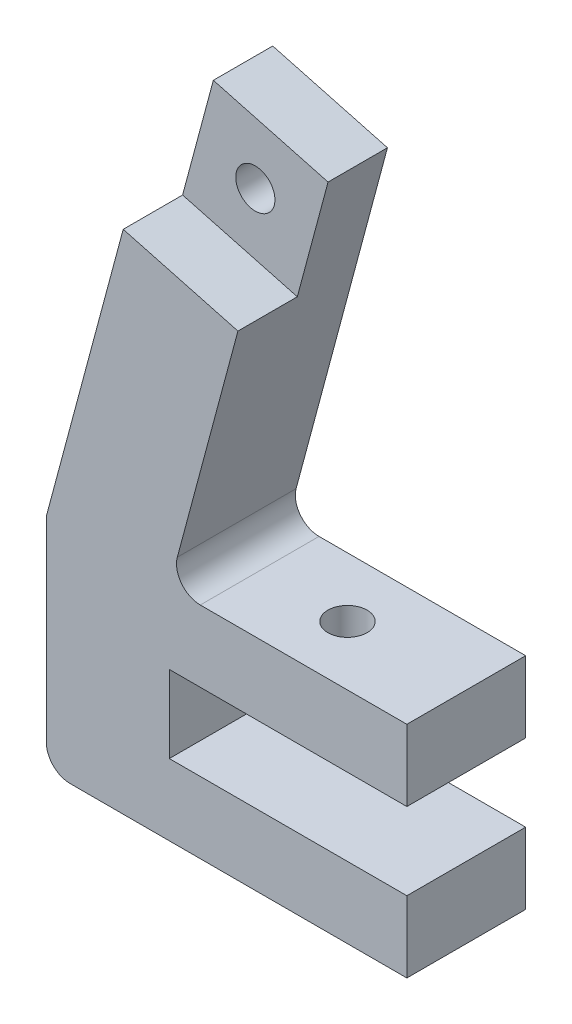
ISO-10303-21;
HEADER;
FILE_DESCRIPTION(('STEP AP214'),'2;1');
FILE_NAME('part.step','',(''),(''),'','','');
FILE_SCHEMA(('AUTOMOTIVE_DESIGN { 1 0 10303 214 1 1 1 1 }'));
ENDSEC;
DATA;
#1=APPLICATION_CONTEXT('core data for automotive mechanical design processes');
#2=APPLICATION_PROTOCOL_DEFINITION('international standard','automotive_design',2000,#1);
#3=PRODUCT_CONTEXT('',#1,'mechanical');
#4=PRODUCT('Part','Part','',(#3));
#5=PRODUCT_RELATED_PRODUCT_CATEGORY('part','',(#4));
#6=PRODUCT_DEFINITION_FORMATION('','',#4);
#7=PRODUCT_DEFINITION_CONTEXT('part definition',#1,'design');
#8=PRODUCT_DEFINITION('design','',#6,#7);
#9=PRODUCT_DEFINITION_SHAPE('','',#8);
#10=(LENGTH_UNIT() NAMED_UNIT(*) SI_UNIT(.MILLI.,.METRE.));
#11=(NAMED_UNIT(*) PLANE_ANGLE_UNIT() SI_UNIT($,.RADIAN.));
#12=(NAMED_UNIT(*) SI_UNIT($,.STERADIAN.) SOLID_ANGLE_UNIT());
#13=UNCERTAINTY_MEASURE_WITH_UNIT(LENGTH_MEASURE(1.E-05),#10,'distance_accuracy_value','');
#14=(GEOMETRIC_REPRESENTATION_CONTEXT(3) GLOBAL_UNCERTAINTY_ASSIGNED_CONTEXT((#13)) GLOBAL_UNIT_ASSIGNED_CONTEXT((#10,
#11,#12)) REPRESENTATION_CONTEXT('',''));
#15=CARTESIAN_POINT('',(0.,0.,0.));
#16=DIRECTION('',(0.,0.,1.));
#17=DIRECTION('',(1.,0.,0.));
#18=AXIS2_PLACEMENT_3D('',#15,#16,#17);
#19=CARTESIAN_POINT('',(-17.7585613195798,46.1836795631594,5.));
#20=DIRECTION('',(0.,0.,1.));
#21=DIRECTION('',(1.,0.,0.));
#22=AXIS2_PLACEMENT_3D('',#19,#20,#21);
#23=CYLINDRICAL_SURFACE('',#22,1.65);
#24=CARTESIAN_POINT('',(-17.7585613195798,46.1836795631594,5.));
#25=DIRECTION('',(0.,0.,1.));
#26=DIRECTION('',(1.,0.,0.));
#27=AXIS2_PLACEMENT_3D('',#24,#25,#26);
#28=CIRCLE('',#27,1.65);
#29=CARTESIAN_POINT('',(-16.1085613195798,46.1836795631594,5.));
#30=VERTEX_POINT('',#29);
#31=EDGE_CURVE('E412',#30,#30,#28,.T.);
#32=ORIENTED_EDGE('',*,*,#31,.T.);
#33=EDGE_LOOP('',(#32));
#34=FACE_BOUND('',#33,.T.);
#35=CARTESIAN_POINT('',(-17.7585613195798,46.1836795631594,1.));
#36=DIRECTION('',(0.,0.,-1.));
#37=DIRECTION('',(-1.,0.,0.));
#38=AXIS2_PLACEMENT_3D('',#35,#36,#37);
#39=CIRCLE('',#38,1.65);
#40=CARTESIAN_POINT('',(-19.4085613195798,46.1836795631594,1.));
#41=VERTEX_POINT('',#40);
#42=EDGE_CURVE('E43',#41,#41,#39,.F.);
#43=ORIENTED_EDGE('',*,*,#42,.F.);
#44=EDGE_LOOP('',(#43));
#45=FACE_BOUND('',#44,.T.);
#46=ADVANCED_FACE('F39',(#34,#45),#23,.F.);
#47=CARTESIAN_POINT('',(0.,18.5,10.));
#48=DIRECTION('',(0.,-1.,0.));
#49=DIRECTION('',(1.,0.,0.));
#50=AXIS2_PLACEMENT_3D('',#47,#48,#49);
#51=PLANE('',#50);
#52=DIRECTION('',(-1.,0.,0.));
#53=VECTOR('',#52,1.);
#54=CARTESIAN_POINT('',(0.,18.5,0.));
#55=LINE('',#54,#53);
#56=CARTESIAN_POINT('',(0.,18.5,0.));
#57=VERTEX_POINT('',#56);
#58=CARTESIAN_POINT('',(-17.3935492543176,18.5,0.));
#59=VERTEX_POINT('',#58);
#60=EDGE_CURVE('E233',#57,#59,#55,.T.);
#61=ORIENTED_EDGE('',*,*,#60,.T.);
#62=DIRECTION('',(0.,0.,-1.));
#63=VECTOR('',#62,1.);
#64=CARTESIAN_POINT('',(-17.3935492543176,18.5,10.));
#65=LINE('',#64,#63);
#66=CARTESIAN_POINT('',(-17.3935492543176,18.5,10.));
#67=VERTEX_POINT('',#66);
#68=EDGE_CURVE('E287',#59,#67,#65,.F.);
#69=ORIENTED_EDGE('',*,*,#68,.T.);
#70=DIRECTION('',(-1.,0.,0.));
#71=VECTOR('',#70,1.);
#72=CARTESIAN_POINT('',(0.,18.5,10.));
#73=LINE('',#72,#71);
#74=CARTESIAN_POINT('',(0.,18.5,10.));
#75=VERTEX_POINT('',#74);
#76=EDGE_CURVE('E203',#75,#67,#73,.T.);
#77=ORIENTED_EDGE('',*,*,#76,.F.);
#78=DIRECTION('',(0.,0.,-1.));
#79=VECTOR('',#78,1.);
#80=CARTESIAN_POINT('',(0.,18.5,10.));
#81=LINE('',#80,#79);
#82=EDGE_CURVE('E259',#75,#57,#81,.T.);
#83=ORIENTED_EDGE('',*,*,#82,.T.);
#84=EDGE_LOOP('',(#61,#69,#77,#83));
#85=FACE_BOUND('',#84,.T.);
#86=CARTESIAN_POINT('',(-10.,18.5,5.));
#87=DIRECTION('',(0.,1.,0.));
#88=DIRECTION('',(0.,0.,1.));
#89=AXIS2_PLACEMENT_3D('',#86,#87,#88);
#90=CIRCLE('',#89,1.65);
#91=CARTESIAN_POINT('',(-10.,18.5,6.65));
#92=VERTEX_POINT('',#91);
#93=EDGE_CURVE('E407',#92,#92,#90,.T.);
#94=ORIENTED_EDGE('',*,*,#93,.F.);
#95=EDGE_LOOP('',(#94));
#96=FACE_BOUND('',#95,.T.);
#97=ADVANCED_FACE('F336',(#85,#96),#51,.F.);
#98=CARTESIAN_POINT('',(-30.3527618041008,0.,10.));
#99=DIRECTION('',(0.,1.,0.));
#100=DIRECTION('',(0.,0.,1.));
#101=AXIS2_PLACEMENT_3D('',#98,#99,#100);
#102=PLANE('',#101);
#103=DIRECTION('',(1.,0.,0.));
#104=VECTOR('',#103,1.);
#105=CARTESIAN_POINT('',(-30.3527618041008,0.,10.));
#106=LINE('',#105,#104);
#107=CARTESIAN_POINT('',(-28.3527618041008,0.,10.));
#108=VERTEX_POINT('',#107);
#109=CARTESIAN_POINT('',(0.,0.,10.));
#110=VERTEX_POINT('',#109);
#111=EDGE_CURVE('E184',#108,#110,#106,.T.);
#112=ORIENTED_EDGE('',*,*,#111,.F.);
#113=DIRECTION('',(0.,0.,-1.));
#114=VECTOR('',#113,1.);
#115=CARTESIAN_POINT('',(-28.3527618041008,0.,10.));
#116=LINE('',#115,#114);
#117=CARTESIAN_POINT('',(-28.3527618041008,0.,0.));
#118=VERTEX_POINT('',#117);
#119=EDGE_CURVE('E296',#108,#118,#116,.T.);
#120=ORIENTED_EDGE('',*,*,#119,.T.);
#121=DIRECTION('',(1.,0.,0.));
#122=VECTOR('',#121,1.);
#123=CARTESIAN_POINT('',(-30.3527618041008,0.,0.));
#124=LINE('',#123,#122);
#125=CARTESIAN_POINT('',(0.,0.,0.));
#126=VERTEX_POINT('',#125);
#127=EDGE_CURVE('E179',#118,#126,#124,.T.);
#128=ORIENTED_EDGE('',*,*,#127,.T.);
#129=DIRECTION('',(0.,0.,-1.));
#130=VECTOR('',#129,1.);
#131=CARTESIAN_POINT('',(0.,0.,10.));
#132=LINE('',#131,#130);
#133=EDGE_CURVE('E279',#110,#126,#132,.T.);
#134=ORIENTED_EDGE('',*,*,#133,.F.);
#135=EDGE_LOOP('',(#112,#120,#128,#134));
#136=FACE_BOUND('',#135,.T.);
#137=ADVANCED_FACE('F306',(#136),#102,.F.);
#138=CARTESIAN_POINT('',(0.,0.,10.));
#139=DIRECTION('',(-1.,0.,0.));
#140=DIRECTION('',(0.,0.,1.));
#141=AXIS2_PLACEMENT_3D('',#138,#139,#140);
#142=PLANE('',#141);
#143=DIRECTION('',(0.,1.,0.));
#144=VECTOR('',#143,1.);
#145=CARTESIAN_POINT('',(0.,0.,0.));
#146=LINE('',#145,#144);
#147=CARTESIAN_POINT('',(0.,6.,0.));
#148=VERTEX_POINT('',#147);
#149=EDGE_CURVE('E218',#126,#148,#146,.T.);
#150=ORIENTED_EDGE('',*,*,#149,.T.);
#151=DIRECTION('',(0.,0.,-1.));
#152=VECTOR('',#151,1.);
#153=CARTESIAN_POINT('',(0.,6.,10.));
#154=LINE('',#153,#152);
#155=CARTESIAN_POINT('',(0.,6.,10.));
#156=VERTEX_POINT('',#155);
#157=EDGE_CURVE('E275',#156,#148,#154,.T.);
#158=ORIENTED_EDGE('',*,*,#157,.F.);
#159=DIRECTION('',(0.,1.,0.));
#160=VECTOR('',#159,1.);
#161=CARTESIAN_POINT('',(0.,0.,10.));
#162=LINE('',#161,#160);
#163=EDGE_CURVE('E187',#110,#156,#162,.T.);
#164=ORIENTED_EDGE('',*,*,#163,.F.);
#165=ORIENTED_EDGE('',*,*,#133,.T.);
#166=EDGE_LOOP('',(#150,#158,#164,#165));
#167=FACE_BOUND('',#166,.T.);
#168=ADVANCED_FACE('F317',(#167),#142,.F.);
#169=CARTESIAN_POINT('',(0.,6.,10.));
#170=DIRECTION('',(0.,-1.,0.));
#171=DIRECTION('',(1.,0.,0.));
#172=AXIS2_PLACEMENT_3D('',#169,#170,#171);
#173=PLANE('',#172);
#174=DIRECTION('',(-1.,0.,0.));
#175=VECTOR('',#174,1.);
#176=CARTESIAN_POINT('',(0.,6.,0.));
#177=LINE('',#176,#175);
#178=CARTESIAN_POINT('',(-20.,6.,0.));
#179=VERTEX_POINT('',#178);
#180=EDGE_CURVE('E221',#148,#179,#177,.T.);
#181=ORIENTED_EDGE('',*,*,#180,.T.);
#182=DIRECTION('',(0.,0.,-1.));
#183=VECTOR('',#182,1.);
#184=CARTESIAN_POINT('',(-20.,6.,10.));
#185=LINE('',#184,#183);
#186=CARTESIAN_POINT('',(-20.,6.,10.));
#187=VERTEX_POINT('',#186);
#188=EDGE_CURVE('E271',#187,#179,#185,.T.);
#189=ORIENTED_EDGE('',*,*,#188,.F.);
#190=DIRECTION('',(-1.,0.,0.));
#191=VECTOR('',#190,1.);
#192=CARTESIAN_POINT('',(0.,6.,10.));
#193=LINE('',#192,#191);
#194=EDGE_CURVE('E191',#156,#187,#193,.T.);
#195=ORIENTED_EDGE('',*,*,#194,.F.);
#196=ORIENTED_EDGE('',*,*,#157,.T.);
#197=EDGE_LOOP('',(#181,#189,#195,#196));
#198=FACE_BOUND('',#197,.T.);
#199=ADVANCED_FACE('F382',(#198),#173,.F.);
#200=CARTESIAN_POINT('',(-20.,6.,10.));
#201=DIRECTION('',(-1.,0.,0.));
#202=DIRECTION('',(0.,0.,1.));
#203=AXIS2_PLACEMENT_3D('',#200,#201,#202);
#204=PLANE('',#203);
#205=DIRECTION('',(0.,1.,0.));
#206=VECTOR('',#205,1.);
#207=CARTESIAN_POINT('',(-20.,6.,0.));
#208=LINE('',#207,#206);
#209=CARTESIAN_POINT('',(-20.,12.5,0.));
#210=VERTEX_POINT('',#209);
#211=EDGE_CURVE('E224',#179,#210,#208,.T.);
#212=ORIENTED_EDGE('',*,*,#211,.T.);
#213=DIRECTION('',(0.,0.,-1.));
#214=VECTOR('',#213,1.);
#215=CARTESIAN_POINT('',(-20.,12.5,10.));
#216=LINE('',#215,#214);
#217=CARTESIAN_POINT('',(-20.,12.5,10.));
#218=VERTEX_POINT('',#217);
#219=EDGE_CURVE('E267',#218,#210,#216,.T.);
#220=ORIENTED_EDGE('',*,*,#219,.F.);
#221=DIRECTION('',(0.,1.,0.));
#222=VECTOR('',#221,1.);
#223=CARTESIAN_POINT('',(-20.,6.,10.));
#224=LINE('',#223,#222);
#225=EDGE_CURVE('E194',#187,#218,#224,.T.);
#226=ORIENTED_EDGE('',*,*,#225,.F.);
#227=ORIENTED_EDGE('',*,*,#188,.T.);
#228=EDGE_LOOP('',(#212,#220,#226,#227));
#229=FACE_BOUND('',#228,.T.);
#230=ADVANCED_FACE('F378',(#229),#204,.F.);
#231=CARTESIAN_POINT('',(-20.,12.5,10.));
#232=DIRECTION('',(0.,1.,0.));
#233=DIRECTION('',(0.,0.,1.));
#234=AXIS2_PLACEMENT_3D('',#231,#232,#233);
#235=PLANE('',#234);
#236=CARTESIAN_POINT('',(-10.,12.5,5.));
#237=DIRECTION('',(0.,1.,0.));
#238=DIRECTION('',(0.,0.,1.));
#239=AXIS2_PLACEMENT_3D('',#236,#237,#238);
#240=CIRCLE('',#239,1.65);
#241=CARTESIAN_POINT('',(-10.,12.5,6.65));
#242=VERTEX_POINT('',#241);
#243=EDGE_CURVE('E404',#242,#242,#240,.T.);
#244=ORIENTED_EDGE('',*,*,#243,.T.);
#245=EDGE_LOOP('',(#244));
#246=FACE_BOUND('',#245,.T.);
#247=DIRECTION('',(1.,0.,0.));
#248=VECTOR('',#247,1.);
#249=CARTESIAN_POINT('',(-20.,12.5,0.));
#250=LINE('',#249,#248);
#251=CARTESIAN_POINT('',(0.,12.5,0.));
#252=VERTEX_POINT('',#251);
#253=EDGE_CURVE('E227',#210,#252,#250,.T.);
#254=ORIENTED_EDGE('',*,*,#253,.T.);
#255=DIRECTION('',(0.,0.,-1.));
#256=VECTOR('',#255,1.);
#257=CARTESIAN_POINT('',(0.,12.5,10.));
#258=LINE('',#257,#256);
#259=CARTESIAN_POINT('',(0.,12.5,10.));
#260=VERTEX_POINT('',#259);
#261=EDGE_CURVE('E263',#260,#252,#258,.T.);
#262=ORIENTED_EDGE('',*,*,#261,.F.);
#263=DIRECTION('',(1.,0.,0.));
#264=VECTOR('',#263,1.);
#265=CARTESIAN_POINT('',(-20.,12.5,10.));
#266=LINE('',#265,#264);
#267=EDGE_CURVE('E197',#218,#260,#266,.T.);
#268=ORIENTED_EDGE('',*,*,#267,.F.);
#269=ORIENTED_EDGE('',*,*,#219,.T.);
#270=EDGE_LOOP('',(#254,#262,#268,#269));
#271=FACE_BOUND('',#270,.T.);
#272=ADVANCED_FACE('F374',(#246,#271),#235,.F.);
#273=CARTESIAN_POINT('',(0.,12.5,10.));
#274=DIRECTION('',(-1.,0.,0.));
#275=DIRECTION('',(0.,0.,1.));
#276=AXIS2_PLACEMENT_3D('',#273,#274,#275);
#277=PLANE('',#276);
#278=DIRECTION('',(0.,1.,0.));
#279=VECTOR('',#278,1.);
#280=CARTESIAN_POINT('',(0.,12.5,0.));
#281=LINE('',#280,#279);
#282=EDGE_CURVE('E230',#252,#57,#281,.T.);
#283=ORIENTED_EDGE('',*,*,#282,.T.);
#284=ORIENTED_EDGE('',*,*,#82,.F.);
#285=DIRECTION('',(0.,1.,0.));
#286=VECTOR('',#285,1.);
#287=CARTESIAN_POINT('',(0.,12.5,10.));
#288=LINE('',#287,#286);
#289=EDGE_CURVE('E200',#260,#75,#288,.T.);
#290=ORIENTED_EDGE('',*,*,#289,.F.);
#291=ORIENTED_EDGE('',*,*,#261,.T.);
#292=EDGE_LOOP('',(#283,#284,#290,#291));
#293=FACE_BOUND('',#292,.T.);
#294=ADVANCED_FACE('F369',(#293),#277,.F.);
#295=CARTESIAN_POINT('',(-20.,18.5,10.));
#296=DIRECTION('',(-0.965925826289067,0.258819045102525,0.));
#297=DIRECTION('',(-0.258819045102525,-0.965925826289067,0.));
#298=AXIS2_PLACEMENT_3D('',#295,#296,#297);
#299=PLANE('',#298);
#300=DIRECTION('',(0.258819045102525,0.965925826289067,0.));
#301=VECTOR('',#300,1.);
#302=CARTESIAN_POINT('',(-20.,18.5,10.));
#303=LINE('',#302,#301);
#304=CARTESIAN_POINT('',(-19.3254009068957,21.017638090205,10.));
#305=VERTEX_POINT('',#304);
#306=CARTESIAN_POINT('',(-14.223027413647,40.0599552062014,10.));
#307=VERTEX_POINT('',#306);
#308=EDGE_CURVE('E207',#305,#307,#303,.T.);
#309=ORIENTED_EDGE('',*,*,#308,.F.);
#310=DIRECTION('',(0.,0.,-1.));
#311=VECTOR('',#310,1.);
#312=CARTESIAN_POINT('',(-19.3254009068957,21.017638090205,0.));
#313=LINE('',#312,#311);
#314=CARTESIAN_POINT('',(-19.3254009068957,21.017638090205,0.));
#315=VERTEX_POINT('',#314);
#316=EDGE_CURVE('E283',#305,#315,#313,.T.);
#317=ORIENTED_EDGE('',*,*,#316,.T.);
#318=DIRECTION('',(0.258819045102525,0.965925826289067,0.));
#319=VECTOR('',#318,1.);
#320=CARTESIAN_POINT('',(-20.,18.5,0.));
#321=LINE('',#320,#319);
#322=CARTESIAN_POINT('',(-11.6348369626218,49.7192134690921,0.));
#323=VERTEX_POINT('',#322);
#324=EDGE_CURVE('E237',#315,#323,#321,.T.);
#325=ORIENTED_EDGE('',*,*,#324,.T.);
#326=DIRECTION('',(0.,0.,-1.));
#327=VECTOR('',#326,1.);
#328=CARTESIAN_POINT('',(-11.6348369626218,49.7192134690921,10.));
#329=LINE('',#328,#327);
#330=CARTESIAN_POINT('',(-11.6348369626218,49.7192134690921,5.));
#331=VERTEX_POINT('',#330);
#332=EDGE_CURVE('E255',#331,#323,#329,.T.);
#333=ORIENTED_EDGE('',*,*,#332,.F.);
#334=DIRECTION('',(0.258819045102524,0.965925826289067,0.));
#335=VECTOR('',#334,1.);
#336=CARTESIAN_POINT('',(-11.6348369626218,49.7192134690921,5.));
#337=LINE('',#336,#335);
#338=CARTESIAN_POINT('',(-14.223027413647,40.0599552062014,5.));
#339=VERTEX_POINT('',#338);
#340=EDGE_CURVE('E159',#339,#331,#337,.T.);
#341=ORIENTED_EDGE('',*,*,#340,.F.);
#342=DIRECTION('',(0.,0.,1.));
#343=VECTOR('',#342,1.);
#344=CARTESIAN_POINT('',(-14.223027413647,40.0599552062014,5.));
#345=LINE('',#344,#343);
#346=EDGE_CURVE('E155',#339,#307,#345,.T.);
#347=ORIENTED_EDGE('',*,*,#346,.T.);
#348=EDGE_LOOP('',(#309,#317,#325,#333,#341,#347));
#349=FACE_BOUND('',#348,.T.);
#350=ADVANCED_FACE('F366',(#349),#299,.F.);
#351=CARTESIAN_POINT('',(-11.6348369626218,49.7192134690921,10.));
#352=DIRECTION('',(-0.258819045102525,-0.965925826289067,0.));
#353=DIRECTION('',(0.965925826289067,-0.258819045102525,0.));
#354=AXIS2_PLACEMENT_3D('',#351,#352,#353);
#355=PLANE('',#354);
#356=DIRECTION('',(0.,0.,-1.));
#357=VECTOR('',#356,1.);
#358=CARTESIAN_POINT('',(-21.2940952255125,52.3074039201174,10.));
#359=LINE('',#358,#357);
#360=CARTESIAN_POINT('',(-21.2940952255125,52.3074039201174,5.));
#361=VERTEX_POINT('',#360);
#362=CARTESIAN_POINT('',(-21.2940952255125,52.3074039201174,0.));
#363=VERTEX_POINT('',#362);
#364=EDGE_CURVE('E252',#361,#363,#359,.T.);
#365=ORIENTED_EDGE('',*,*,#364,.F.);
#366=DIRECTION('',(-0.965925826289067,0.258819045102525,0.));
#367=VECTOR('',#366,1.);
#368=CARTESIAN_POINT('',(-21.2940952255125,52.3074039201174,5.));
#369=LINE('',#368,#367);
#370=EDGE_CURVE('E165',#331,#361,#369,.T.);
#371=ORIENTED_EDGE('',*,*,#370,.F.);
#372=ORIENTED_EDGE('',*,*,#332,.T.);
#373=DIRECTION('',(-0.965925826289067,0.258819045102525,0.));
#374=VECTOR('',#373,1.);
#375=CARTESIAN_POINT('',(-11.6348369626218,49.7192134690921,0.));
#376=LINE('',#375,#374);
#377=EDGE_CURVE('E240',#323,#363,#376,.T.);
#378=ORIENTED_EDGE('',*,*,#377,.T.);
#379=EDGE_LOOP('',(#365,#371,#372,#378));
#380=FACE_BOUND('',#379,.T.);
#381=ADVANCED_FACE('F363',(#380),#355,.F.);
#382=CARTESIAN_POINT('',(-21.2940952255125,52.3074039201174,10.));
#383=DIRECTION('',(0.965925826289067,-0.258819045102524,0.));
#384=DIRECTION('',(0.258819045102524,0.965925826289068,0.));
#385=AXIS2_PLACEMENT_3D('',#382,#383,#384);
#386=PLANE('',#385);
#387=DIRECTION('',(-0.258819045102524,-0.965925826289067,0.));
#388=VECTOR('',#387,1.);
#389=CARTESIAN_POINT('',(-21.2940952255125,52.3074039201174,10.));
#390=LINE('',#389,#388);
#391=CARTESIAN_POINT('',(-23.8822856765377,42.6481456572267,10.));
#392=VERTEX_POINT('',#391);
#393=CARTESIAN_POINT('',(-30.3527618041008,18.5,10.));
#394=VERTEX_POINT('',#393);
#395=EDGE_CURVE('E174',#392,#394,#390,.T.);
#396=ORIENTED_EDGE('',*,*,#395,.F.);
#397=DIRECTION('',(0.,0.,1.));
#398=VECTOR('',#397,1.);
#399=CARTESIAN_POINT('',(-23.8822856765377,42.6481456572267,5.));
#400=LINE('',#399,#398);
#401=CARTESIAN_POINT('',(-23.8822856765377,42.6481456572267,5.));
#402=VERTEX_POINT('',#401);
#403=EDGE_CURVE('E152',#402,#392,#400,.T.);
#404=ORIENTED_EDGE('',*,*,#403,.F.);
#405=DIRECTION('',(-0.258819045102524,-0.965925826289067,0.));
#406=VECTOR('',#405,1.);
#407=CARTESIAN_POINT('',(-23.8822856765377,42.6481456572267,5.));
#408=LINE('',#407,#406);
#409=EDGE_CURVE('E160',#361,#402,#408,.T.);
#410=ORIENTED_EDGE('',*,*,#409,.F.);
#411=ORIENTED_EDGE('',*,*,#364,.T.);
#412=DIRECTION('',(-0.258819045102524,-0.965925826289067,0.));
#413=VECTOR('',#412,1.);
#414=CARTESIAN_POINT('',(-21.2940952255125,52.3074039201174,0.));
#415=LINE('',#414,#413);
#416=CARTESIAN_POINT('',(-30.3527618041008,18.5,0.));
#417=VERTEX_POINT('',#416);
#418=EDGE_CURVE('E244',#363,#417,#415,.T.);
#419=ORIENTED_EDGE('',*,*,#418,.T.);
#420=DIRECTION('',(0.,0.,-1.));
#421=VECTOR('',#420,1.);
#422=CARTESIAN_POINT('',(-30.3527618041008,18.5,10.));
#423=LINE('',#422,#421);
#424=EDGE_CURVE('E215',#394,#417,#423,.T.);
#425=ORIENTED_EDGE('',*,*,#424,.F.);
#426=EDGE_LOOP('',(#396,#404,#410,#411,#419,#425));
#427=FACE_BOUND('',#426,.T.);
#428=ADVANCED_FACE('F172',(#427),#386,.F.);
#429=CARTESIAN_POINT('',(-30.3527618041008,18.5,10.));
#430=DIRECTION('',(1.,0.,0.));
#431=DIRECTION('',(0.,0.,-1.));
#432=AXIS2_PLACEMENT_3D('',#429,#430,#431);
#433=PLANE('',#432);
#434=DIRECTION('',(0.,-1.,0.));
#435=VECTOR('',#434,1.);
#436=CARTESIAN_POINT('',(-30.3527618041008,18.5,0.));
#437=LINE('',#436,#435);
#438=CARTESIAN_POINT('',(-30.3527618041008,2.,0.));
#439=VERTEX_POINT('',#438);
#440=EDGE_CURVE('E188',#417,#439,#437,.T.);
#441=ORIENTED_EDGE('',*,*,#440,.T.);
#442=DIRECTION('',(0.,0.,-1.));
#443=VECTOR('',#442,1.);
#444=CARTESIAN_POINT('',(-30.3527618041008,2.,10.));
#445=LINE('',#444,#443);
#446=CARTESIAN_POINT('',(-30.3527618041008,2.,10.));
#447=VERTEX_POINT('',#446);
#448=EDGE_CURVE('E49',#439,#447,#445,.F.);
#449=ORIENTED_EDGE('',*,*,#448,.T.);
#450=DIRECTION('',(0.,-1.,0.));
#451=VECTOR('',#450,1.);
#452=CARTESIAN_POINT('',(-30.3527618041008,18.5,10.));
#453=LINE('',#452,#451);
#454=EDGE_CURVE('E212',#394,#447,#453,.T.);
#455=ORIENTED_EDGE('',*,*,#454,.F.);
#456=ORIENTED_EDGE('',*,*,#424,.T.);
#457=EDGE_LOOP('',(#441,#449,#455,#456));
#458=FACE_BOUND('',#457,.T.);
#459=ADVANCED_FACE('F355',(#458),#433,.F.);
#460=CARTESIAN_POINT('',(0.,0.,10.));
#461=DIRECTION('',(0.,0.,1.));
#462=DIRECTION('',(1.,0.,0.));
#463=AXIS2_PLACEMENT_3D('',#460,#461,#462);
#464=PLANE('',#463);
#465=ORIENTED_EDGE('',*,*,#454,.T.);
#466=CARTESIAN_POINT('',(-28.3527618041008,2.,10.));
#467=DIRECTION('',(0.,0.,1.));
#468=DIRECTION('',(1.,0.,0.));
#469=AXIS2_PLACEMENT_3D('',#466,#467,#468);
#470=CIRCLE('',#469,2.);
#471=EDGE_CURVE('E11',#447,#108,#470,.T.);
#472=ORIENTED_EDGE('',*,*,#471,.T.);
#473=ORIENTED_EDGE('',*,*,#111,.T.);
#474=ORIENTED_EDGE('',*,*,#163,.T.);
#475=ORIENTED_EDGE('',*,*,#194,.T.);
#476=ORIENTED_EDGE('',*,*,#225,.T.);
#477=ORIENTED_EDGE('',*,*,#267,.T.);
#478=ORIENTED_EDGE('',*,*,#289,.T.);
#479=ORIENTED_EDGE('',*,*,#76,.T.);
#480=CARTESIAN_POINT('',(-17.3935492543176,20.5,10.));
#481=DIRECTION('',(0.,0.,1.));
#482=DIRECTION('',(1.,0.,0.));
#483=AXIS2_PLACEMENT_3D('',#480,#481,#482);
#484=CIRCLE('',#483,2.);
#485=EDGE_CURVE('E293',#67,#305,#484,.F.);
#486=ORIENTED_EDGE('',*,*,#485,.T.);
#487=ORIENTED_EDGE('',*,*,#308,.T.);
#488=DIRECTION('',(0.965925826289068,-0.258819045102524,0.));
#489=VECTOR('',#488,1.);
#490=CARTESIAN_POINT('',(-14.223027413647,40.0599552062014,10.));
#491=LINE('',#490,#489);
#492=EDGE_CURVE('E169',#392,#307,#491,.T.);
#493=ORIENTED_EDGE('',*,*,#492,.F.);
#494=ORIENTED_EDGE('',*,*,#395,.T.);
#495=EDGE_LOOP('',(#465,#472,#473,#474,#475,#476,#477,#478,#479,#486,#487,#493,#494));
#496=FACE_BOUND('',#495,.T.);
#497=ADVANCED_FACE('F320',(#496),#464,.T.);
#498=CARTESIAN_POINT('',(0.,0.,0.));
#499=DIRECTION('',(0.,0.,1.));
#500=DIRECTION('',(1.,0.,0.));
#501=AXIS2_PLACEMENT_3D('',#498,#499,#500);
#502=PLANE('',#501);
#503=CARTESIAN_POINT('',(-17.7585613195798,46.1836795631594,0.));
#504=DIRECTION('',(0.,0.,-1.));
#505=DIRECTION('',(-1.,0.,0.));
#506=AXIS2_PLACEMENT_3D('',#503,#504,#505);
#507=CIRCLE('',#506,4.);
#508=CARTESIAN_POINT('',(-21.7585613195798,46.1836795631594,0.));
#509=VERTEX_POINT('',#508);
#510=EDGE_CURVE('E417',#509,#509,#507,.T.);
#511=ORIENTED_EDGE('',*,*,#510,.F.);
#512=EDGE_LOOP('',(#511));
#513=FACE_BOUND('',#512,.T.);
#514=ORIENTED_EDGE('',*,*,#127,.F.);
#515=CARTESIAN_POINT('',(-28.3527618041008,2.,0.));
#516=DIRECTION('',(0.,0.,1.));
#517=DIRECTION('',(1.,0.,0.));
#518=AXIS2_PLACEMENT_3D('',#515,#516,#517);
#519=CIRCLE('',#518,2.);
#520=EDGE_CURVE('E63',#118,#439,#519,.F.);
#521=ORIENTED_EDGE('',*,*,#520,.T.);
#522=ORIENTED_EDGE('',*,*,#440,.F.);
#523=ORIENTED_EDGE('',*,*,#418,.F.);
#524=ORIENTED_EDGE('',*,*,#377,.F.);
#525=ORIENTED_EDGE('',*,*,#324,.F.);
#526=CARTESIAN_POINT('',(-17.3935492543176,20.5,0.));
#527=DIRECTION('',(0.,0.,1.));
#528=DIRECTION('',(1.,0.,0.));
#529=AXIS2_PLACEMENT_3D('',#526,#527,#528);
#530=CIRCLE('',#529,2.);
#531=EDGE_CURVE('E290',#315,#59,#530,.T.);
#532=ORIENTED_EDGE('',*,*,#531,.T.);
#533=ORIENTED_EDGE('',*,*,#60,.F.);
#534=ORIENTED_EDGE('',*,*,#282,.F.);
#535=ORIENTED_EDGE('',*,*,#253,.F.);
#536=ORIENTED_EDGE('',*,*,#211,.F.);
#537=ORIENTED_EDGE('',*,*,#180,.F.);
#538=ORIENTED_EDGE('',*,*,#149,.F.);
#539=EDGE_LOOP('',(#514,#521,#522,#523,#524,#525,#532,#533,#534,#535,#536,#537,#538));
#540=FACE_BOUND('',#539,.T.);
#541=ADVANCED_FACE('F311',(#513,#540),#502,.F.);
#542=CARTESIAN_POINT('',(-14.223027413647,40.0599552062014,5.));
#543=DIRECTION('',(-0.258819045102524,-0.965925826289068,0.));
#544=DIRECTION('',(0.965925826289068,-0.258819045102524,0.));
#545=AXIS2_PLACEMENT_3D('',#542,#543,#544);
#546=PLANE('',#545);
#547=ORIENTED_EDGE('',*,*,#492,.T.);
#548=ORIENTED_EDGE('',*,*,#346,.F.);
#549=DIRECTION('',(0.965925826289068,-0.258819045102524,0.));
#550=VECTOR('',#549,1.);
#551=CARTESIAN_POINT('',(-14.223027413647,40.0599552062014,5.));
#552=LINE('',#551,#550);
#553=EDGE_CURVE('E147',#402,#339,#552,.T.);
#554=ORIENTED_EDGE('',*,*,#553,.F.);
#555=ORIENTED_EDGE('',*,*,#403,.T.);
#556=EDGE_LOOP('',(#547,#548,#554,#555));
#557=FACE_BOUND('',#556,.T.);
#558=ADVANCED_FACE('F150',(#557),#546,.F.);
#559=CARTESIAN_POINT('',(0.,0.,5.));
#560=DIRECTION('',(0.,0.,-1.));
#561=DIRECTION('',(-1.,0.,0.));
#562=AXIS2_PLACEMENT_3D('',#559,#560,#561);
#563=PLANE('',#562);
#564=ORIENTED_EDGE('',*,*,#31,.F.);
#565=EDGE_LOOP('',(#564));
#566=FACE_BOUND('',#565,.T.);
#567=ORIENTED_EDGE('',*,*,#409,.T.);
#568=ORIENTED_EDGE('',*,*,#553,.T.);
#569=ORIENTED_EDGE('',*,*,#340,.T.);
#570=ORIENTED_EDGE('',*,*,#370,.T.);
#571=EDGE_LOOP('',(#567,#568,#569,#570));
#572=FACE_BOUND('',#571,.T.);
#573=ADVANCED_FACE('F163',(#566,#572),#563,.F.);
#574=CARTESIAN_POINT('',(-17.3935492543176,20.5,10.));
#575=DIRECTION('',(0.,0.,1.));
#576=DIRECTION('',(1.,0.,0.));
#577=AXIS2_PLACEMENT_3D('',#574,#575,#576);
#578=CYLINDRICAL_SURFACE('',#577,2.);
#579=ORIENTED_EDGE('',*,*,#485,.F.);
#580=ORIENTED_EDGE('',*,*,#68,.F.);
#581=ORIENTED_EDGE('',*,*,#531,.F.);
#582=ORIENTED_EDGE('',*,*,#316,.F.);
#583=EDGE_LOOP('',(#579,#580,#581,#582));
#584=FACE_BOUND('',#583,.T.);
#585=ADVANCED_FACE('F332',(#584),#578,.F.);
#586=CARTESIAN_POINT('',(-10.,18.5,5.));
#587=DIRECTION('',(0.,1.,0.));
#588=DIRECTION('',(0.,0.,1.));
#589=AXIS2_PLACEMENT_3D('',#586,#587,#588);
#590=CYLINDRICAL_SURFACE('',#589,1.65);
#591=ORIENTED_EDGE('',*,*,#243,.F.);
#592=EDGE_LOOP('',(#591));
#593=FACE_BOUND('',#592,.T.);
#594=ORIENTED_EDGE('',*,*,#93,.T.);
#595=EDGE_LOOP('',(#594));
#596=FACE_BOUND('',#595,.T.);
#597=ADVANCED_FACE('F324',(#593,#596),#590,.F.);
#598=CARTESIAN_POINT('',(-28.3527618041008,2.,10.));
#599=DIRECTION('',(0.,0.,-1.));
#600=DIRECTION('',(-1.,0.,0.));
#601=AXIS2_PLACEMENT_3D('',#598,#599,#600);
#602=CYLINDRICAL_SURFACE('',#601,2.);
#603=ORIENTED_EDGE('',*,*,#471,.F.);
#604=ORIENTED_EDGE('',*,*,#448,.F.);
#605=ORIENTED_EDGE('',*,*,#520,.F.);
#606=ORIENTED_EDGE('',*,*,#119,.F.);
#607=EDGE_LOOP('',(#603,#604,#605,#606));
#608=FACE_BOUND('',#607,.T.);
#609=ADVANCED_FACE('F41',(#608),#602,.T.);
#610=CARTESIAN_POINT('',(-17.7585613195798,46.1836795631594,1.));
#611=DIRECTION('',(0.,0.,-1.));
#612=DIRECTION('',(-1.,0.,0.));
#613=AXIS2_PLACEMENT_3D('',#610,#611,#612);
#614=PLANE('',#613);
#615=CARTESIAN_POINT('',(-17.7585613195798,46.1836795631594,1.));
#616=DIRECTION('',(0.,0.,-1.));
#617=DIRECTION('',(-1.,0.,0.));
#618=AXIS2_PLACEMENT_3D('',#615,#616,#617);
#619=CIRCLE('',#618,4.);
#620=CARTESIAN_POINT('',(-21.7585613195798,46.1836795631594,1.));
#621=VERTEX_POINT('',#620);
#622=EDGE_CURVE('E421',#621,#621,#619,.T.);
#623=ORIENTED_EDGE('',*,*,#622,.T.);
#624=EDGE_LOOP('',(#623));
#625=FACE_BOUND('',#624,.T.);
#626=ORIENTED_EDGE('',*,*,#42,.T.);
#627=EDGE_LOOP('',(#626));
#628=FACE_BOUND('',#627,.T.);
#629=ADVANCED_FACE('F323',(#625,#628),#614,.T.);
#630=CARTESIAN_POINT('',(-17.7585613195798,46.1836795631594,1.));
#631=DIRECTION('',(0.,0.,-1.));
#632=DIRECTION('',(-1.,0.,0.));
#633=AXIS2_PLACEMENT_3D('',#630,#631,#632);
#634=CYLINDRICAL_SURFACE('',#633,4.);
#635=ORIENTED_EDGE('',*,*,#622,.F.);
#636=EDGE_LOOP('',(#635));
#637=FACE_BOUND('',#636,.T.);
#638=ORIENTED_EDGE('',*,*,#510,.T.);
#639=EDGE_LOOP('',(#638));
#640=FACE_BOUND('',#639,.T.);
#641=ADVANCED_FACE('F329',(#637,#640),#634,.F.);
#642=CLOSED_SHELL('',(#46,#97,#137,#168,#199,#230,#272,#294,#350,#381,#428,#459,#497,#541,#558,
#573,#585,#597,#609,#629,#641));
#643=MANIFOLD_SOLID_BREP('B2',#642);
#644=ADVANCED_BREP_SHAPE_REPRESENTATION('',(#18,#643),#14);
#645=SHAPE_DEFINITION_REPRESENTATION(#9,#644);
ENDSEC;
END-ISO-10303-21;
